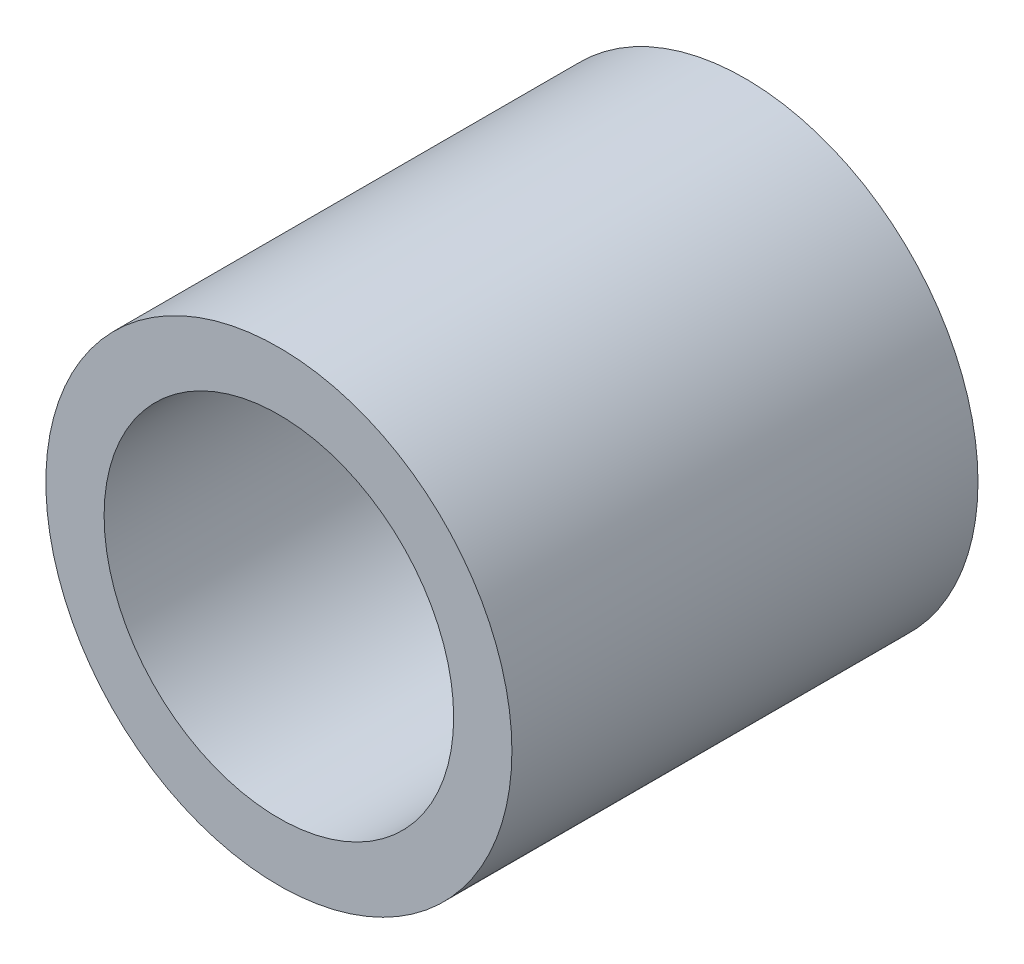
ISO-10303-21;
HEADER;
FILE_DESCRIPTION(('STEP AP214'),'2;1');
FILE_NAME('part.step','',(''),(''),'','','');
FILE_SCHEMA(('AUTOMOTIVE_DESIGN { 1 0 10303 214 1 1 1 1 }'));
ENDSEC;
DATA;
#1=APPLICATION_CONTEXT('core data for automotive mechanical design processes');
#2=APPLICATION_PROTOCOL_DEFINITION('international standard','automotive_design',2000,#1);
#3=PRODUCT_CONTEXT('',#1,'mechanical');
#4=PRODUCT('Part','Part','',(#3));
#5=PRODUCT_RELATED_PRODUCT_CATEGORY('part','',(#4));
#6=PRODUCT_DEFINITION_FORMATION('','',#4);
#7=PRODUCT_DEFINITION_CONTEXT('part definition',#1,'design');
#8=PRODUCT_DEFINITION('design','',#6,#7);
#9=PRODUCT_DEFINITION_SHAPE('','',#8);
#10=(LENGTH_UNIT() NAMED_UNIT(*) SI_UNIT(.MILLI.,.METRE.));
#11=(NAMED_UNIT(*) PLANE_ANGLE_UNIT() SI_UNIT($,.RADIAN.));
#12=(NAMED_UNIT(*) SI_UNIT($,.STERADIAN.) SOLID_ANGLE_UNIT());
#13=UNCERTAINTY_MEASURE_WITH_UNIT(LENGTH_MEASURE(1.E-05),#10,'distance_accuracy_value','');
#14=(GEOMETRIC_REPRESENTATION_CONTEXT(3) GLOBAL_UNCERTAINTY_ASSIGNED_CONTEXT((#13)) GLOBAL_UNIT_ASSIGNED_CONTEXT((#10,
#11,#12)) REPRESENTATION_CONTEXT('',''));
#15=CARTESIAN_POINT('',(0.,0.,0.));
#16=DIRECTION('',(0.,0.,1.));
#17=DIRECTION('',(1.,0.,0.));
#18=AXIS2_PLACEMENT_3D('',#15,#16,#17);
#19=CARTESIAN_POINT('',(0.,0.,4.));
#20=DIRECTION('',(0.,0.,1.));
#21=DIRECTION('',(1.,0.,0.));
#22=AXIS2_PLACEMENT_3D('',#19,#20,#21);
#23=PLANE('',#22);
#24=CARTESIAN_POINT('',(0.,0.,4.));
#25=DIRECTION('',(0.,0.,1.));
#26=DIRECTION('',(1.,0.,0.));
#27=AXIS2_PLACEMENT_3D('',#24,#25,#26);
#28=CIRCLE('',#27,2.);
#29=CARTESIAN_POINT('',(2.,0.,4.));
#30=VERTEX_POINT('',#29);
#31=EDGE_CURVE('E10',#30,#30,#28,.T.);
#32=ORIENTED_EDGE('',*,*,#31,.T.);
#33=EDGE_LOOP('',(#32));
#34=FACE_BOUND('',#33,.T.);
#35=CARTESIAN_POINT('',(0.,0.,4.));
#36=DIRECTION('',(0.,0.,1.));
#37=DIRECTION('',(1.,0.,0.));
#38=AXIS2_PLACEMENT_3D('',#35,#36,#37);
#39=CIRCLE('',#38,1.5);
#40=CARTESIAN_POINT('',(1.5,0.,4.));
#41=VERTEX_POINT('',#40);
#42=EDGE_CURVE('E41',#41,#41,#39,.T.);
#43=ORIENTED_EDGE('',*,*,#42,.F.);
#44=EDGE_LOOP('',(#43));
#45=FACE_BOUND('',#44,.T.);
#46=ADVANCED_FACE('F30',(#34,#45),#23,.T.);
#47=CARTESIAN_POINT('',(0.,0.,0.));
#48=DIRECTION('',(0.,0.,1.));
#49=DIRECTION('',(1.,0.,0.));
#50=AXIS2_PLACEMENT_3D('',#47,#48,#49);
#51=PLANE('',#50);
#52=CARTESIAN_POINT('',(0.,0.,0.));
#53=DIRECTION('',(0.,0.,1.));
#54=DIRECTION('',(1.,0.,0.));
#55=AXIS2_PLACEMENT_3D('',#52,#53,#54);
#56=CIRCLE('',#55,2.);
#57=CARTESIAN_POINT('',(2.,0.,0.));
#58=VERTEX_POINT('',#57);
#59=EDGE_CURVE('E34',#58,#58,#56,.T.);
#60=ORIENTED_EDGE('',*,*,#59,.F.);
#61=EDGE_LOOP('',(#60));
#62=FACE_BOUND('',#61,.T.);
#63=CARTESIAN_POINT('',(0.,0.,0.));
#64=DIRECTION('',(0.,0.,1.));
#65=DIRECTION('',(1.,0.,0.));
#66=AXIS2_PLACEMENT_3D('',#63,#64,#65);
#67=CIRCLE('',#66,1.5);
#68=CARTESIAN_POINT('',(1.5,0.,0.));
#69=VERTEX_POINT('',#68);
#70=EDGE_CURVE('E43',#69,#69,#67,.T.);
#71=ORIENTED_EDGE('',*,*,#70,.T.);
#72=EDGE_LOOP('',(#71));
#73=FACE_BOUND('',#72,.T.);
#74=ADVANCED_FACE('F53',(#62,#73),#51,.F.);
#75=CARTESIAN_POINT('',(0.,0.,4.));
#76=DIRECTION('',(0.,0.,-1.));
#77=DIRECTION('',(-1.,0.,0.));
#78=AXIS2_PLACEMENT_3D('',#75,#76,#77);
#79=CYLINDRICAL_SURFACE('',#78,2.);
#80=ORIENTED_EDGE('',*,*,#31,.F.);
#81=EDGE_LOOP('',(#80));
#82=FACE_BOUND('',#81,.T.);
#83=ORIENTED_EDGE('',*,*,#59,.T.);
#84=EDGE_LOOP('',(#83));
#85=FACE_BOUND('',#84,.T.);
#86=ADVANCED_FACE('F32',(#82,#85),#79,.T.);
#87=CARTESIAN_POINT('',(0.,0.,4.));
#88=DIRECTION('',(0.,0.,-1.));
#89=DIRECTION('',(-1.,0.,0.));
#90=AXIS2_PLACEMENT_3D('',#87,#88,#89);
#91=CYLINDRICAL_SURFACE('',#90,1.5);
#92=ORIENTED_EDGE('',*,*,#42,.T.);
#93=EDGE_LOOP('',(#92));
#94=FACE_BOUND('',#93,.T.);
#95=ORIENTED_EDGE('',*,*,#70,.F.);
#96=EDGE_LOOP('',(#95));
#97=FACE_BOUND('',#96,.T.);
#98=ADVANCED_FACE('F49',(#94,#97),#91,.F.);
#99=CLOSED_SHELL('',(#46,#74,#86,#98));
#100=MANIFOLD_SOLID_BREP('B2',#99);
#101=ADVANCED_BREP_SHAPE_REPRESENTATION('',(#18,#100),#14);
#102=SHAPE_DEFINITION_REPRESENTATION(#9,#101);
ENDSEC;
END-ISO-10303-21;
